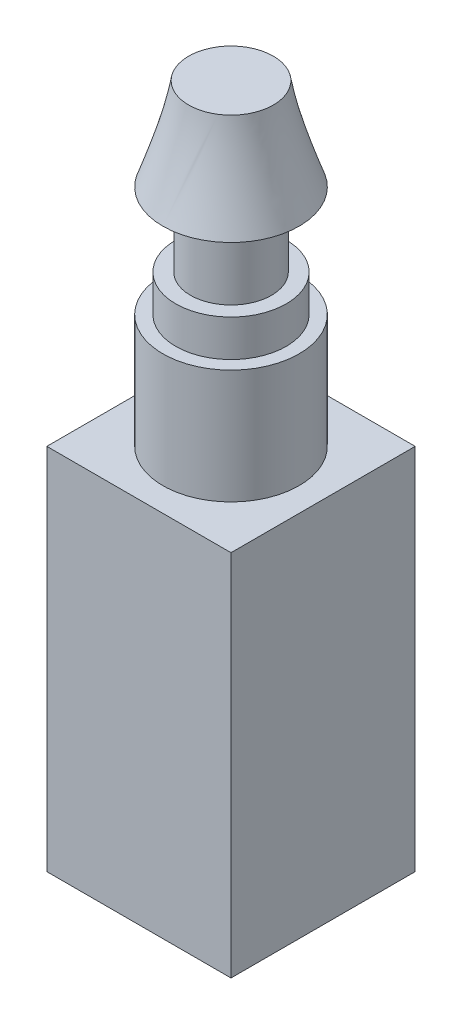
ISO-10303-21;
HEADER;
FILE_DESCRIPTION(('STEP AP214'),'2;1');
FILE_NAME('part.step','',(''),(''),'','','');
FILE_SCHEMA(('AUTOMOTIVE_DESIGN { 1 0 10303 214 1 1 1 1 }'));
ENDSEC;
DATA;
#1=APPLICATION_CONTEXT('core data for automotive mechanical design processes');
#2=APPLICATION_PROTOCOL_DEFINITION('international standard','automotive_design',2000,#1);
#3=PRODUCT_CONTEXT('',#1,'mechanical');
#4=PRODUCT('Part','Part','',(#3));
#5=PRODUCT_RELATED_PRODUCT_CATEGORY('part','',(#4));
#6=PRODUCT_DEFINITION_FORMATION('','',#4);
#7=PRODUCT_DEFINITION_CONTEXT('part definition',#1,'design');
#8=PRODUCT_DEFINITION('design','',#6,#7);
#9=PRODUCT_DEFINITION_SHAPE('','',#8);
#10=(LENGTH_UNIT() NAMED_UNIT(*) SI_UNIT(.MILLI.,.METRE.));
#11=(NAMED_UNIT(*) PLANE_ANGLE_UNIT() SI_UNIT($,.RADIAN.));
#12=(NAMED_UNIT(*) SI_UNIT($,.STERADIAN.) SOLID_ANGLE_UNIT());
#13=UNCERTAINTY_MEASURE_WITH_UNIT(LENGTH_MEASURE(1.E-05),#10,'distance_accuracy_value','');
#14=(GEOMETRIC_REPRESENTATION_CONTEXT(3) GLOBAL_UNCERTAINTY_ASSIGNED_CONTEXT((#13)) GLOBAL_UNIT_ASSIGNED_CONTEXT((#10,
#11,#12)) REPRESENTATION_CONTEXT('',''));
#15=CARTESIAN_POINT('',(0.,0.,0.));
#16=DIRECTION('',(0.,0.,1.));
#17=DIRECTION('',(1.,0.,0.));
#18=AXIS2_PLACEMENT_3D('',#15,#16,#17);
#19=CARTESIAN_POINT('',(0.,3.1,0.));
#20=DIRECTION('',(0.,-1.,0.));
#21=DIRECTION('',(0.,0.,-1.));
#22=AXIS2_PLACEMENT_3D('',#19,#20,#21);
#23=CYLINDRICAL_SURFACE('',#22,1.85);
#24=CARTESIAN_POINT('',(0.,3.1,0.));
#25=DIRECTION('',(0.,1.,0.));
#26=DIRECTION('',(0.,0.,1.));
#27=AXIS2_PLACEMENT_3D('',#24,#25,#26);
#28=CIRCLE('',#27,1.85);
#29=CARTESIAN_POINT('',(0.,3.1,-1.85));
#30=VERTEX_POINT('',#29);
#31=EDGE_CURVE('E174',#30,#30,#28,.T.);
#32=CARTESIAN_POINT('',(0.,0.,0.));
#33=DIRECTION('',(0.,1.,0.));
#34=DIRECTION('',(0.,0.,1.));
#35=AXIS2_PLACEMENT_3D('',#32,#33,#34);
#36=CIRCLE('',#35,1.85);
#37=CARTESIAN_POINT('',(0.,0.,-1.85));
#38=VERTEX_POINT('',#37);
#39=EDGE_CURVE('E42',#38,#38,#36,.T.);
#40=CARTESIAN_POINT('',(0.,3.1,-1.85));
#41=CARTESIAN_POINT('',(0.,3.06770833333333,-1.85));
#42=CARTESIAN_POINT('',(0.,3.03541666666667,-1.85));
#43=CARTESIAN_POINT('',(0.,2.97083333333333,-1.85));
#44=CARTESIAN_POINT('',(0.,2.93854166666667,-1.85));
#45=CARTESIAN_POINT('',(0.,2.87395833333333,-1.85));
#46=CARTESIAN_POINT('',(0.,2.84166666666667,-1.85));
#47=CARTESIAN_POINT('',(0.,2.77708333333333,-1.85));
#48=CARTESIAN_POINT('',(0.,2.74479166666667,-1.85));
#49=CARTESIAN_POINT('',(0.,2.68020833333333,-1.85));
#50=CARTESIAN_POINT('',(0.,2.64791666666667,-1.85));
#51=CARTESIAN_POINT('',(0.,2.58333333333333,-1.85));
#52=CARTESIAN_POINT('',(0.,2.55104166666667,-1.85));
#53=CARTESIAN_POINT('',(0.,2.48645833333333,-1.85));
#54=CARTESIAN_POINT('',(0.,2.45416666666667,-1.85));
#55=CARTESIAN_POINT('',(0.,2.38958333333333,-1.85));
#56=CARTESIAN_POINT('',(0.,2.35729166666667,-1.85));
#57=CARTESIAN_POINT('',(0.,2.29270833333333,-1.85));
#58=CARTESIAN_POINT('',(0.,2.26041666666667,-1.85));
#59=CARTESIAN_POINT('',(0.,2.19583333333333,-1.85));
#60=CARTESIAN_POINT('',(0.,2.16354166666667,-1.85));
#61=CARTESIAN_POINT('',(0.,2.09895833333333,-1.85));
#62=CARTESIAN_POINT('',(0.,2.06666666666667,-1.85));
#63=CARTESIAN_POINT('',(0.,2.00208333333333,-1.85));
#64=CARTESIAN_POINT('',(0.,1.96979166666667,-1.85));
#65=CARTESIAN_POINT('',(0.,1.90520833333333,-1.85));
#66=CARTESIAN_POINT('',(0.,1.87291666666667,-1.85));
#67=CARTESIAN_POINT('',(0.,1.80833333333333,-1.85));
#68=CARTESIAN_POINT('',(0.,1.77604166666667,-1.85));
#69=CARTESIAN_POINT('',(0.,1.71145833333333,-1.85));
#70=CARTESIAN_POINT('',(0.,1.67916666666667,-1.85));
#71=CARTESIAN_POINT('',(0.,1.61458333333333,-1.85));
#72=CARTESIAN_POINT('',(0.,1.58229166666667,-1.85));
#73=CARTESIAN_POINT('',(0.,1.51770833333333,-1.85));
#74=CARTESIAN_POINT('',(0.,1.48541666666667,-1.85));
#75=CARTESIAN_POINT('',(0.,1.42083333333333,-1.85));
#76=CARTESIAN_POINT('',(0.,1.38854166666667,-1.85));
#77=CARTESIAN_POINT('',(0.,1.32395833333333,-1.85));
#78=CARTESIAN_POINT('',(0.,1.29166666666667,-1.85));
#79=CARTESIAN_POINT('',(0.,1.22708333333333,-1.85));
#80=CARTESIAN_POINT('',(0.,1.19479166666667,-1.85));
#81=CARTESIAN_POINT('',(0.,1.13020833333333,-1.85));
#82=CARTESIAN_POINT('',(0.,1.09791666666667,-1.85));
#83=CARTESIAN_POINT('',(0.,1.03333333333333,-1.85));
#84=CARTESIAN_POINT('',(0.,1.00104166666667,-1.85));
#85=CARTESIAN_POINT('',(0.,0.936458333333333,-1.85));
#86=CARTESIAN_POINT('',(0.,0.904166666666667,-1.85));
#87=CARTESIAN_POINT('',(0.,0.839583333333333,-1.85));
#88=CARTESIAN_POINT('',(0.,0.807291666666667,-1.85));
#89=CARTESIAN_POINT('',(0.,0.742708333333333,-1.85));
#90=CARTESIAN_POINT('',(0.,0.710416666666667,-1.85));
#91=CARTESIAN_POINT('',(0.,0.645833333333333,-1.85));
#92=CARTESIAN_POINT('',(0.,0.613541666666667,-1.85));
#93=CARTESIAN_POINT('',(0.,0.548958333333333,-1.85));
#94=CARTESIAN_POINT('',(0.,0.516666666666667,-1.85));
#95=CARTESIAN_POINT('',(0.,0.452083333333333,-1.85));
#96=CARTESIAN_POINT('',(0.,0.419791666666667,-1.85));
#97=CARTESIAN_POINT('',(0.,0.355208333333333,-1.85));
#98=CARTESIAN_POINT('',(0.,0.322916666666667,-1.85));
#99=CARTESIAN_POINT('',(0.,0.258333333333333,-1.85));
#100=CARTESIAN_POINT('',(0.,0.226041666666667,-1.85));
#101=CARTESIAN_POINT('',(0.,0.161458333333333,-1.85));
#102=CARTESIAN_POINT('',(0.,0.129166666666667,-1.85));
#103=CARTESIAN_POINT('',(0.,0.0645833333333335,-1.85));
#104=CARTESIAN_POINT('',(0.,0.0322916666666667,-1.85));
#105=CARTESIAN_POINT('',(0.,0.,-1.85));
#106=B_SPLINE_CURVE_WITH_KNOTS('',3,(#40,#41,#42,#43,#44,#45,#46,#47,#48,#49,#50,#51,#52,#53,
#54,#55,#56,#57,#58,#59,#60,#61,#62,#63,#64,#65,#66,#67,#68,#69,#70,#71,#72,#73,#74,#75,#76,#77,
#78,#79,#80,#81,#82,#83,#84,#85,#86,#87,#88,#89,#90,#91,#92,#93,#94,#95,#96,#97,#98,#99,#100,
#101,#102,#103,#104,#105),.UNSPECIFIED.,.F.,.F.,(4,2,2,2,2,2,2,2,2,2,2,2,2,2,2,2,2,2,2,2,2,2,2,
2,2,2,2,2,2,2,2,2,4),(0.,0.0968749999999997,0.19375,0.290625,0.3875,0.484375,0.58125,0.678125,
0.775,0.871874999999999,0.96875,1.065625,1.1625,1.259375,1.35625,1.453125,1.55,1.646875,1.74375,
1.840625,1.9375,2.034375,2.13125,2.228125,2.325,2.421875,2.51875,2.615625,2.7125,2.809375,
2.90625,3.003125,3.1),.UNSPECIFIED.);
#107=EDGE_CURVE('BSEAM39',#30,#38,#106,.T.);
#108=ORIENTED_EDGE('',*,*,#31,.F.);
#109=ORIENTED_EDGE('',*,*,#39,.T.);
#110=ORIENTED_EDGE('',*,*,#107,.T.);
#111=ORIENTED_EDGE('',*,*,#107,.F.);
#112=EDGE_LOOP('',(#108,#110,#109,#111));
#113=FACE_BOUND('',#112,.T.);
#114=ADVANCED_FACE('F39',(#113),#23,.T.);
#115=CARTESIAN_POINT('',(0.,3.1,0.));
#116=DIRECTION('',(0.,1.,0.));
#117=DIRECTION('',(0.,0.,1.));
#118=AXIS2_PLACEMENT_3D('',#115,#116,#117);
#119=PLANE('',#118);
#120=CARTESIAN_POINT('',(0.,3.1,0.));
#121=DIRECTION('',(0.,1.,0.));
#122=DIRECTION('',(0.,0.,1.));
#123=AXIS2_PLACEMENT_3D('',#120,#121,#122);
#124=CIRCLE('',#123,1.5);
#125=CARTESIAN_POINT('',(0.,3.1,1.5));
#126=VERTEX_POINT('',#125);
#127=EDGE_CURVE('E48',#126,#126,#124,.T.);
#128=ORIENTED_EDGE('',*,*,#127,.F.);
#129=EDGE_LOOP('',(#128));
#130=FACE_BOUND('',#129,.T.);
#131=ORIENTED_EDGE('',*,*,#31,.T.);
#132=EDGE_LOOP('',(#131));
#133=FACE_BOUND('',#132,.T.);
#134=ADVANCED_FACE('F179',(#130,#133),#119,.T.);
#135=CARTESIAN_POINT('',(0.,4.1,0.));
#136=DIRECTION('',(0.,-1.,0.));
#137=DIRECTION('',(0.,0.,-1.));
#138=AXIS2_PLACEMENT_3D('',#135,#136,#137);
#139=CYLINDRICAL_SURFACE('',#138,1.5);
#140=CARTESIAN_POINT('',(0.,4.1,0.));
#141=DIRECTION('',(0.,1.,0.));
#142=DIRECTION('',(0.,0.,1.));
#143=AXIS2_PLACEMENT_3D('',#140,#141,#142);
#144=CIRCLE('',#143,1.5);
#145=CARTESIAN_POINT('',(0.,4.1,1.5));
#146=VERTEX_POINT('',#145);
#147=EDGE_CURVE('E170',#146,#146,#144,.T.);
#148=ORIENTED_EDGE('',*,*,#147,.F.);
#149=EDGE_LOOP('',(#148));
#150=FACE_BOUND('',#149,.T.);
#151=ORIENTED_EDGE('',*,*,#127,.T.);
#152=EDGE_LOOP('',(#151));
#153=FACE_BOUND('',#152,.T.);
#154=ADVANCED_FACE('F202',(#150,#153),#139,.T.);
#155=CARTESIAN_POINT('',(0.,4.1,0.));
#156=DIRECTION('',(0.,1.,0.));
#157=DIRECTION('',(0.,0.,1.));
#158=AXIS2_PLACEMENT_3D('',#155,#156,#157);
#159=PLANE('',#158);
#160=CARTESIAN_POINT('',(0.,4.1,0.));
#161=DIRECTION('',(0.,1.,0.));
#162=DIRECTION('',(0.,0.,1.));
#163=AXIS2_PLACEMENT_3D('',#160,#161,#162);
#164=CIRCLE('',#163,1.1);
#165=CARTESIAN_POINT('',(0.,4.1,1.1));
#166=VERTEX_POINT('',#165);
#167=EDGE_CURVE('E12',#166,#166,#164,.T.);
#168=ORIENTED_EDGE('',*,*,#167,.F.);
#169=EDGE_LOOP('',(#168));
#170=FACE_BOUND('',#169,.T.);
#171=ORIENTED_EDGE('',*,*,#147,.T.);
#172=EDGE_LOOP('',(#171));
#173=FACE_BOUND('',#172,.T.);
#174=ADVANCED_FACE('F197',(#170,#173),#159,.T.);
#175=CARTESIAN_POINT('',(0.,6.1,0.));
#176=DIRECTION('',(0.,-1.,0.));
#177=DIRECTION('',(0.,0.,-1.));
#178=AXIS2_PLACEMENT_3D('',#175,#176,#177);
#179=CYLINDRICAL_SURFACE('',#178,1.1);
#180=CARTESIAN_POINT('',(0.,6.1,0.));
#181=DIRECTION('',(0.,1.,0.));
#182=DIRECTION('',(0.,0.,1.));
#183=AXIS2_PLACEMENT_3D('',#180,#181,#182);
#184=CIRCLE('',#183,1.1);
#185=CARTESIAN_POINT('',(0.,6.1,1.1));
#186=VERTEX_POINT('',#185);
#187=EDGE_CURVE('E166',#186,#186,#184,.T.);
#188=ORIENTED_EDGE('',*,*,#187,.F.);
#189=EDGE_LOOP('',(#188));
#190=FACE_BOUND('',#189,.T.);
#191=ORIENTED_EDGE('',*,*,#167,.T.);
#192=EDGE_LOOP('',(#191));
#193=FACE_BOUND('',#192,.T.);
#194=ADVANCED_FACE('F153',(#190,#193),#179,.T.);
#195=CARTESIAN_POINT('',(0.,8.6,0.));
#196=DIRECTION('',(0.,1.,0.));
#197=DIRECTION('',(0.,0.,1.));
#198=AXIS2_PLACEMENT_3D('',#195,#196,#197);
#199=PLANE('',#198);
#200=CARTESIAN_POINT('',(0.,8.6,0.));
#201=DIRECTION('',(0.,1.,0.));
#202=DIRECTION('',(0.,0.,1.));
#203=AXIS2_PLACEMENT_3D('',#200,#201,#202);
#204=CIRCLE('',#203,1.15);
#205=CARTESIAN_POINT('',(0.620465420838555,8.6,0.968257538851949));
#206=VERTEX_POINT('',#205);
#207=EDGE_CURVE('E121',#206,#206,#204,.T.);
#208=ORIENTED_EDGE('',*,*,#207,.T.);
#209=EDGE_LOOP('',(#208));
#210=FACE_BOUND('',#209,.T.);
#211=ADVANCED_FACE('F144',(#210),#199,.T.);
#212=CARTESIAN_POINT('',(0.,6.1,0.));
#213=DIRECTION('',(0.,1.,0.));
#214=DIRECTION('',(0.,0.,1.));
#215=AXIS2_PLACEMENT_3D('',#212,#213,#214);
#216=PLANE('',#215);
#217=ORIENTED_EDGE('',*,*,#187,.T.);
#218=EDGE_LOOP('',(#217));
#219=FACE_BOUND('',#218,.T.);
#220=CARTESIAN_POINT('',(0.,6.1,0.));
#221=DIRECTION('',(0.,1.,0.));
#222=DIRECTION('',(0.,0.,1.));
#223=AXIS2_PLACEMENT_3D('',#220,#221,#222);
#224=CIRCLE('',#223,1.85);
#225=CARTESIAN_POINT('',(0.,6.1,1.85));
#226=VERTEX_POINT('',#225);
#227=EDGE_CURVE('E126',#226,#226,#224,.T.);
#228=ORIENTED_EDGE('',*,*,#227,.F.);
#229=EDGE_LOOP('',(#228));
#230=FACE_BOUND('',#229,.T.);
#231=ADVANCED_FACE('F141',(#219,#230),#216,.F.);
#232=CARTESIAN_POINT('',(0.,6.1,1.85));
#233=CARTESIAN_POINT('',(0.620465420838555,8.6,0.968257538851949));
#234=CARTESIAN_POINT('',(3.7,6.1,1.85));
#235=CARTESIAN_POINT('',(2.55698049854245,8.6,-0.272673302825161));
#236=CARTESIAN_POINT('',(3.7,6.1,-1.85));
#237=CARTESIAN_POINT('',(1.31604965686534,8.6,-2.20918838052906));
#238=CARTESIAN_POINT('',(0.,6.1,-1.85));
#239=CARTESIAN_POINT('',(-0.620465420838555,8.6,-0.96825753885195));
#240=CARTESIAN_POINT('',(-3.7,6.1,-1.85));
#241=CARTESIAN_POINT('',(-2.55698049854246,8.6,0.272673302825162));
#242=CARTESIAN_POINT('',(-3.7,6.1,1.85));
#243=CARTESIAN_POINT('',(-1.31604965686534,8.6,2.20918838052906));
#244=CARTESIAN_POINT('',(0.,6.1,1.85));
#245=CARTESIAN_POINT('',(0.620465420838555,8.6,0.968257538851949));
#246=(BOUNDED_SURFACE() B_SPLINE_SURFACE(3,1,((#232,#233),(#234,#235),(#236,#237),(#238,#239),
(#240,#241),(#242,#243),(#244,#245)),.UNSPECIFIED.,.T.,.F.,.F.) B_SPLINE_SURFACE_WITH_KNOTS((4,
3,4),(2,2),(0.,0.5,1.),(0.,1.),
.UNSPECIFIED.) GEOMETRIC_REPRESENTATION_ITEM() RATIONAL_B_SPLINE_SURFACE(((1.,1.),
(0.333333333333333,0.333333333333333),(0.333333333333333,0.333333333333333),(1.,1.),
(0.333333333333333,0.333333333333333),(0.333333333333333,0.333333333333333),(1.,1.))) REPRESENTATION_ITEM('') SURFACE());
#247=CARTESIAN_POINT('',(0.,6.1,1.85));
#248=CARTESIAN_POINT('',(0.00646318146706835,6.12604166666667,1.84081518269637));
#249=CARTESIAN_POINT('',(0.0129263629341366,6.15208333333333,1.83163036539275));
#250=CARTESIAN_POINT('',(0.0258527258682731,6.20416666666667,1.8132607307855));
#251=CARTESIAN_POINT('',(0.0323159073353414,6.23020833333333,1.80407591348187));
#252=CARTESIAN_POINT('',(0.045242270269478,6.28229166666667,1.78570627887462));
#253=CARTESIAN_POINT('',(0.0517054517365463,6.30833333333333,1.776521461571));
#254=CARTESIAN_POINT('',(0.0646318146706829,6.36041666666667,1.75815182696374));
#255=CARTESIAN_POINT('',(0.0710949961377511,6.38645833333333,1.74896700966012));
#256=CARTESIAN_POINT('',(0.0840213590718877,6.43854166666667,1.73059737505287));
#257=CARTESIAN_POINT('',(0.090484540538956,6.46458333333333,1.72141255774924));
#258=CARTESIAN_POINT('',(0.103410903473093,6.51666666666667,1.70304292314199));
#259=CARTESIAN_POINT('',(0.109874084940161,6.54270833333333,1.69385810583837));
#260=CARTESIAN_POINT('',(0.122800447874297,6.59479166666667,1.67548847123112));
#261=CARTESIAN_POINT('',(0.129263629341366,6.62083333333333,1.66630365392749));
#262=CARTESIAN_POINT('',(0.142189992275502,6.67291666666667,1.64793401932024));
#263=CARTESIAN_POINT('',(0.148653173742571,6.69895833333333,1.63874920201661));
#264=CARTESIAN_POINT('',(0.161579536676707,6.75104166666667,1.62037956740936));
#265=CARTESIAN_POINT('',(0.168042718143775,6.77708333333333,1.61119475010574));
#266=CARTESIAN_POINT('',(0.180969081077912,6.82916666666667,1.59282511549849));
#267=CARTESIAN_POINT('',(0.18743226254498,6.85520833333333,1.58364029819486));
#268=CARTESIAN_POINT('',(0.200358625479117,6.90729166666667,1.56527066358761));
#269=CARTESIAN_POINT('',(0.206821806946185,6.93333333333333,1.55608584628398));
#270=CARTESIAN_POINT('',(0.219748169880322,6.98541666666667,1.53771621167673));
#271=CARTESIAN_POINT('',(0.22621135134739,7.01145833333333,1.52853139437311));
#272=CARTESIAN_POINT('',(0.239137714281527,7.06354166666667,1.51016175976586));
#273=CARTESIAN_POINT('',(0.245600895748595,7.08958333333333,1.50097694246223));
#274=CARTESIAN_POINT('',(0.258527258682731,7.14166666666667,1.48260730785498));
#275=CARTESIAN_POINT('',(0.2649904401498,7.16770833333333,1.47342249055135));
#276=CARTESIAN_POINT('',(0.277916803083936,7.21979166666667,1.4550528559441));
#277=CARTESIAN_POINT('',(0.284379984551005,7.24583333333333,1.44586803864048));
#278=CARTESIAN_POINT('',(0.297306347485141,7.29791666666667,1.42749840403323));
#279=CARTESIAN_POINT('',(0.303769528952209,7.32395833333333,1.4183135867296));
#280=CARTESIAN_POINT('',(0.316695891886346,7.37604166666667,1.39994395212235));
#281=CARTESIAN_POINT('',(0.323159073353414,7.40208333333333,1.39075913481872));
#282=CARTESIAN_POINT('',(0.336085436287551,7.45416666666667,1.37238950021147));
#283=CARTESIAN_POINT('',(0.342548617754619,7.48020833333333,1.36320468290785));
#284=CARTESIAN_POINT('',(0.355474980688756,7.53229166666667,1.3448350483006));
#285=CARTESIAN_POINT('',(0.361938162155824,7.55833333333333,1.33565023099697));
#286=CARTESIAN_POINT('',(0.374864525089961,7.61041666666667,1.31728059638972));
#287=CARTESIAN_POINT('',(0.381327706557029,7.63645833333333,1.30809577908609));
#288=CARTESIAN_POINT('',(0.394254069491165,7.68854166666667,1.28972614447884));
#289=CARTESIAN_POINT('',(0.400717250958234,7.71458333333333,1.28054132717522));
#290=CARTESIAN_POINT('',(0.41364361389237,7.76666666666667,1.26217169256797));
#291=CARTESIAN_POINT('',(0.420106795359439,7.79270833333333,1.25298687526434));
#292=CARTESIAN_POINT('',(0.433033158293575,7.84479166666667,1.23461724065709));
#293=CARTESIAN_POINT('',(0.439496339760643,7.87083333333333,1.22543242335346));
#294=CARTESIAN_POINT('',(0.45242270269478,7.92291666666667,1.20706278874621));
#295=CARTESIAN_POINT('',(0.458885884161848,7.94895833333333,1.19787797144259));
#296=CARTESIAN_POINT('',(0.471812247095985,8.00104166666667,1.17950833683534));
#297=CARTESIAN_POINT('',(0.478275428563053,8.02708333333333,1.17032351953171));
#298=CARTESIAN_POINT('',(0.49120179149719,8.07916666666667,1.15195388492446));
#299=CARTESIAN_POINT('',(0.497664972964258,8.10520833333333,1.14276906762083));
#300=CARTESIAN_POINT('',(0.510591335898395,8.15729166666667,1.12439943301358));
#301=CARTESIAN_POINT('',(0.517054517365463,8.18333333333333,1.11521461570996));
#302=CARTESIAN_POINT('',(0.529980880299599,8.23541666666667,1.09684498110271));
#303=CARTESIAN_POINT('',(0.536444061766668,8.26145833333333,1.08766016379908));
#304=CARTESIAN_POINT('',(0.549370424700804,8.31354166666667,1.06929052919183));
#305=CARTESIAN_POINT('',(0.555833606167872,8.33958333333333,1.0601057118882));
#306=CARTESIAN_POINT('',(0.568759969102009,8.39166666666667,1.04173607728095));
#307=CARTESIAN_POINT('',(0.575223150569077,8.41770833333333,1.03255125997733));
#308=CARTESIAN_POINT('',(0.588149513503214,8.46979166666667,1.01418162537008));
#309=CARTESIAN_POINT('',(0.594612694970282,8.49583333333333,1.00499680806645));
#310=CARTESIAN_POINT('',(0.607539057904419,8.54791666666667,0.9866271734592));
#311=CARTESIAN_POINT('',(0.614002239371487,8.57395833333333,0.977442356155575));
#312=CARTESIAN_POINT('',(0.620465420838555,8.6,0.968257538851949));
#313=B_SPLINE_CURVE_WITH_KNOTS('',3,(#247,#248,#249,#250,#251,#252,#253,#254,#255,#256,#257,
#258,#259,#260,#261,#262,#263,#264,#265,#266,#267,#268,#269,#270,#271,#272,#273,#274,#275,#276,
#277,#278,#279,#280,#281,#282,#283,#284,#285,#286,#287,#288,#289,#290,#291,#292,#293,#294,#295,
#296,#297,#298,#299,#300,#301,#302,#303,#304,#305,#306,#307,#308,#309,#310,#311,#312),
.UNSPECIFIED.,.F.,.F.,(4,2,2,2,2,2,2,2,2,2,2,2,2,2,2,2,2,2,2,2,2,2,2,2,2,2,2,2,2,2,2,2,4),(0.,
0.0850806551290898,0.17016131025818,0.255241965387269,0.340322620516359,0.425403275645449,
0.510483930774539,0.595564585903629,0.680645241032718,0.765725896161807,0.850806551290897,
0.935887206419988,1.02096786154908,1.10604851667817,1.19112917180726,1.27620982693635,
1.36129048206544,1.44637113719453,1.53145179232361,1.6165324474527,1.70161310258179,
1.78669375771088,1.87177441283997,1.95685506796906,2.04193572309815,2.12701637822724,
2.21209703335633,2.29717768848542,2.38225834361451,2.4673389987436,2.55241965387269,
2.63750030900178,2.72258096413087),.UNSPECIFIED.);
#314=EDGE_CURVE('BSEAM128',#226,#206,#313,.T.);
#315=ORIENTED_EDGE('',*,*,#227,.T.);
#316=ORIENTED_EDGE('',*,*,#207,.F.);
#317=ORIENTED_EDGE('',*,*,#314,.T.);
#318=ORIENTED_EDGE('',*,*,#314,.F.);
#319=EDGE_LOOP('',(#315,#317,#316,#318));
#320=FACE_BOUND('',#319,.T.);
#321=ADVANCED_FACE('F128',(#320),#246,.T.);
#322=CARTESIAN_POINT('',(2.5,-10.,2.5));
#323=DIRECTION('',(-1.,0.,0.));
#324=DIRECTION('',(0.,0.,1.));
#325=AXIS2_PLACEMENT_3D('',#322,#323,#324);
#326=PLANE('',#325);
#327=DIRECTION('',(0.,0.,1.));
#328=VECTOR('',#327,1.);
#329=CARTESIAN_POINT('',(2.5,0.,2.5));
#330=LINE('',#329,#328);
#331=CARTESIAN_POINT('',(2.5,0.,-2.5));
#332=VERTEX_POINT('',#331);
#333=CARTESIAN_POINT('',(2.5,0.,2.5));
#334=VERTEX_POINT('',#333);
#335=EDGE_CURVE('E108',#332,#334,#330,.T.);
#336=ORIENTED_EDGE('',*,*,#335,.T.);
#337=DIRECTION('',(0.,1.,0.));
#338=VECTOR('',#337,1.);
#339=CARTESIAN_POINT('',(2.5,-10.,2.5));
#340=LINE('',#339,#338);
#341=CARTESIAN_POINT('',(2.5,-10.,2.5));
#342=VERTEX_POINT('',#341);
#343=EDGE_CURVE('E99',#342,#334,#340,.T.);
#344=ORIENTED_EDGE('',*,*,#343,.F.);
#345=DIRECTION('',(0.,0.,1.));
#346=VECTOR('',#345,1.);
#347=CARTESIAN_POINT('',(2.5,-10.,2.5));
#348=LINE('',#347,#346);
#349=CARTESIAN_POINT('',(2.5,-10.,-2.5));
#350=VERTEX_POINT('',#349);
#351=EDGE_CURVE('E93',#350,#342,#348,.T.);
#352=ORIENTED_EDGE('',*,*,#351,.F.);
#353=DIRECTION('',(0.,1.,0.));
#354=VECTOR('',#353,1.);
#355=CARTESIAN_POINT('',(2.5,-10.,-2.5));
#356=LINE('',#355,#354);
#357=EDGE_CURVE('E104',#350,#332,#356,.T.);
#358=ORIENTED_EDGE('',*,*,#357,.T.);
#359=EDGE_LOOP('',(#336,#344,#352,#358));
#360=FACE_BOUND('',#359,.T.);
#361=ADVANCED_FACE('F140',(#360),#326,.F.);
#362=CARTESIAN_POINT('',(-2.5,-10.,2.5));
#363=DIRECTION('',(0.,0.,-1.));
#364=DIRECTION('',(-1.,0.,0.));
#365=AXIS2_PLACEMENT_3D('',#362,#363,#364);
#366=PLANE('',#365);
#367=DIRECTION('',(-1.,0.,0.));
#368=VECTOR('',#367,1.);
#369=CARTESIAN_POINT('',(-2.5,0.,2.5));
#370=LINE('',#369,#368);
#371=CARTESIAN_POINT('',(-2.5,0.,2.5));
#372=VERTEX_POINT('',#371);
#373=EDGE_CURVE('E98',#334,#372,#370,.T.);
#374=ORIENTED_EDGE('',*,*,#373,.T.);
#375=DIRECTION('',(0.,1.,0.));
#376=VECTOR('',#375,1.);
#377=CARTESIAN_POINT('',(-2.5,-10.,2.5));
#378=LINE('',#377,#376);
#379=CARTESIAN_POINT('',(-2.5,-10.,2.5));
#380=VERTEX_POINT('',#379);
#381=EDGE_CURVE('E96',#380,#372,#378,.T.);
#382=ORIENTED_EDGE('',*,*,#381,.F.);
#383=DIRECTION('',(-1.,0.,0.));
#384=VECTOR('',#383,1.);
#385=CARTESIAN_POINT('',(-2.5,-10.,2.5));
#386=LINE('',#385,#384);
#387=EDGE_CURVE('E88',#342,#380,#386,.T.);
#388=ORIENTED_EDGE('',*,*,#387,.F.);
#389=ORIENTED_EDGE('',*,*,#343,.T.);
#390=EDGE_LOOP('',(#374,#382,#388,#389));
#391=FACE_BOUND('',#390,.T.);
#392=ADVANCED_FACE('F97',(#391),#366,.F.);
#393=CARTESIAN_POINT('',(-2.5,-10.,2.5));
#394=DIRECTION('',(1.,0.,0.));
#395=DIRECTION('',(0.,0.,-1.));
#396=AXIS2_PLACEMENT_3D('',#393,#394,#395);
#397=PLANE('',#396);
#398=DIRECTION('',(0.,0.,-1.));
#399=VECTOR('',#398,1.);
#400=CARTESIAN_POINT('',(-2.5,0.,2.5));
#401=LINE('',#400,#399);
#402=CARTESIAN_POINT('',(-2.5,0.,-2.5));
#403=VERTEX_POINT('',#402);
#404=EDGE_CURVE('E74',#372,#403,#401,.T.);
#405=ORIENTED_EDGE('',*,*,#404,.T.);
#406=DIRECTION('',(0.,1.,0.));
#407=VECTOR('',#406,1.);
#408=CARTESIAN_POINT('',(-2.5,-10.,-2.5));
#409=LINE('',#408,#407);
#410=CARTESIAN_POINT('',(-2.5,-10.,-2.5));
#411=VERTEX_POINT('',#410);
#412=EDGE_CURVE('E100',#411,#403,#409,.T.);
#413=ORIENTED_EDGE('',*,*,#412,.F.);
#414=DIRECTION('',(0.,0.,-1.));
#415=VECTOR('',#414,1.);
#416=CARTESIAN_POINT('',(-2.5,-10.,2.5));
#417=LINE('',#416,#415);
#418=EDGE_CURVE('E91',#380,#411,#417,.T.);
#419=ORIENTED_EDGE('',*,*,#418,.F.);
#420=ORIENTED_EDGE('',*,*,#381,.T.);
#421=EDGE_LOOP('',(#405,#413,#419,#420));
#422=FACE_BOUND('',#421,.T.);
#423=ADVANCED_FACE('F102',(#422),#397,.F.);
#424=CARTESIAN_POINT('',(-2.5,-10.,-2.5));
#425=DIRECTION('',(0.,0.,1.));
#426=DIRECTION('',(1.,0.,0.));
#427=AXIS2_PLACEMENT_3D('',#424,#425,#426);
#428=PLANE('',#427);
#429=DIRECTION('',(1.,0.,0.));
#430=VECTOR('',#429,1.);
#431=CARTESIAN_POINT('',(-2.5,0.,-2.5));
#432=LINE('',#431,#430);
#433=EDGE_CURVE('E80',#403,#332,#432,.T.);
#434=ORIENTED_EDGE('',*,*,#433,.T.);
#435=ORIENTED_EDGE('',*,*,#357,.F.);
#436=DIRECTION('',(1.,0.,0.));
#437=VECTOR('',#436,1.);
#438=CARTESIAN_POINT('',(-2.5,-10.,-2.5));
#439=LINE('',#438,#437);
#440=EDGE_CURVE('E57',#411,#350,#439,.T.);
#441=ORIENTED_EDGE('',*,*,#440,.F.);
#442=ORIENTED_EDGE('',*,*,#412,.T.);
#443=EDGE_LOOP('',(#434,#435,#441,#442));
#444=FACE_BOUND('',#443,.T.);
#445=ADVANCED_FACE('F266',(#444),#428,.F.);
#446=CARTESIAN_POINT('',(0.,-10.,0.));
#447=DIRECTION('',(0.,-1.,0.));
#448=DIRECTION('',(0.,0.,-1.));
#449=AXIS2_PLACEMENT_3D('',#446,#447,#448);
#450=PLANE('',#449);
#451=ORIENTED_EDGE('',*,*,#351,.T.);
#452=ORIENTED_EDGE('',*,*,#387,.T.);
#453=ORIENTED_EDGE('',*,*,#418,.T.);
#454=ORIENTED_EDGE('',*,*,#440,.T.);
#455=EDGE_LOOP('',(#451,#452,#453,#454));
#456=FACE_BOUND('',#455,.T.);
#457=ADVANCED_FACE('F89',(#456),#450,.T.);
#458=CARTESIAN_POINT('',(0.,0.,0.));
#459=DIRECTION('',(0.,-1.,0.));
#460=DIRECTION('',(0.,0.,-1.));
#461=AXIS2_PLACEMENT_3D('',#458,#459,#460);
#462=PLANE('',#461);
#463=ORIENTED_EDGE('',*,*,#39,.F.);
#464=EDGE_LOOP('',(#463));
#465=FACE_BOUND('',#464,.T.);
#466=ORIENTED_EDGE('',*,*,#335,.F.);
#467=ORIENTED_EDGE('',*,*,#433,.F.);
#468=ORIENTED_EDGE('',*,*,#404,.F.);
#469=ORIENTED_EDGE('',*,*,#373,.F.);
#470=EDGE_LOOP('',(#466,#467,#468,#469));
#471=FACE_BOUND('',#470,.T.);
#472=ADVANCED_FACE('F283',(#465,#471),#462,.F.);
#473=CLOSED_SHELL('',(#114,#134,#154,#174,#194,#211,#231,#321,#361,#392,#423,#445,#457,#472));
#474=MANIFOLD_SOLID_BREP('B2',#473);
#475=ADVANCED_BREP_SHAPE_REPRESENTATION('',(#18,#474),#14);
#476=SHAPE_DEFINITION_REPRESENTATION(#9,#475);
ENDSEC;
END-ISO-10303-21;
